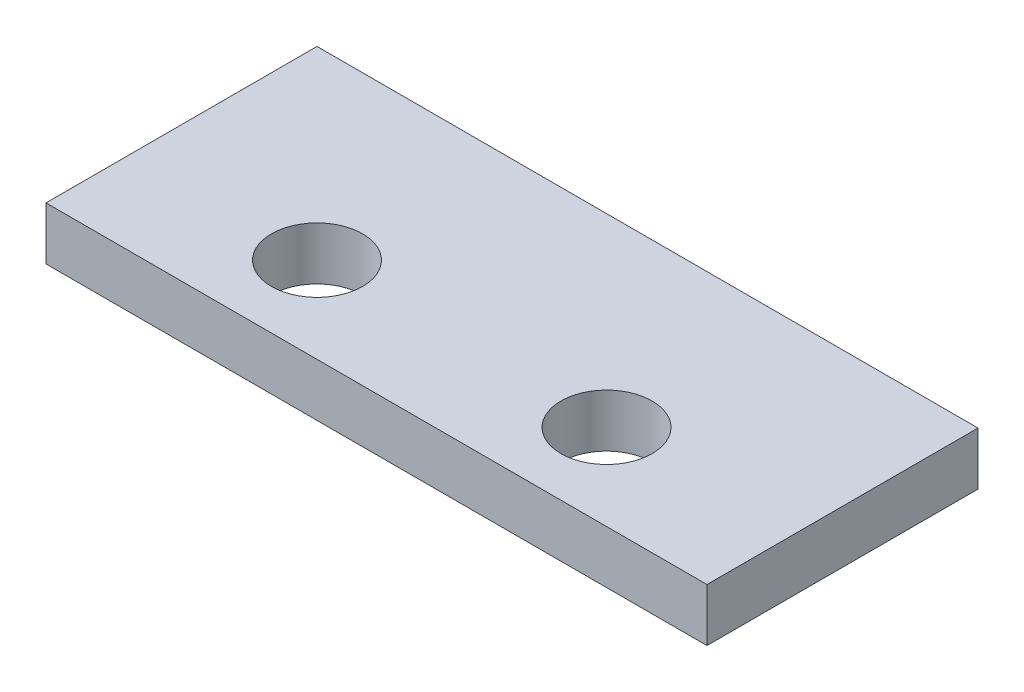
ISO-10303-21;
HEADER;
FILE_DESCRIPTION(('STEP AP214'),'2;1');
FILE_NAME('part.step','',(''),(''),'','','');
FILE_SCHEMA(('AUTOMOTIVE_DESIGN { 1 0 10303 214 1 1 1 1 }'));
ENDSEC;
DATA;
#1=APPLICATION_CONTEXT('core data for automotive mechanical design processes');
#2=APPLICATION_PROTOCOL_DEFINITION('international standard','automotive_design',2000,#1);
#3=PRODUCT_CONTEXT('',#1,'mechanical');
#4=PRODUCT('Part','Part','',(#3));
#5=PRODUCT_RELATED_PRODUCT_CATEGORY('part','',(#4));
#6=PRODUCT_DEFINITION_FORMATION('','',#4);
#7=PRODUCT_DEFINITION_CONTEXT('part definition',#1,'design');
#8=PRODUCT_DEFINITION('design','',#6,#7);
#9=PRODUCT_DEFINITION_SHAPE('','',#8);
#10=(LENGTH_UNIT() NAMED_UNIT(*) SI_UNIT(.MILLI.,.METRE.));
#11=(NAMED_UNIT(*) PLANE_ANGLE_UNIT() SI_UNIT($,.RADIAN.));
#12=(NAMED_UNIT(*) SI_UNIT($,.STERADIAN.) SOLID_ANGLE_UNIT());
#13=UNCERTAINTY_MEASURE_WITH_UNIT(LENGTH_MEASURE(1.E-05),#10,'distance_accuracy_value','');
#14=(GEOMETRIC_REPRESENTATION_CONTEXT(3) GLOBAL_UNCERTAINTY_ASSIGNED_CONTEXT((#13)) GLOBAL_UNIT_ASSIGNED_CONTEXT((#10,
#11,#12)) REPRESENTATION_CONTEXT('',''));
#15=CARTESIAN_POINT('',(0.,0.,0.));
#16=DIRECTION('',(0.,0.,1.));
#17=DIRECTION('',(1.,0.,0.));
#18=AXIS2_PLACEMENT_3D('',#15,#16,#17);
#19=CARTESIAN_POINT('',(0.,2.032,0.));
#20=DIRECTION('',(0.,1.,0.));
#21=DIRECTION('',(0.,0.,1.));
#22=AXIS2_PLACEMENT_3D('',#19,#20,#21);
#23=PLANE('',#22);
#24=CARTESIAN_POINT('',(-4.53841322314049,2.032,4.58302066115703));
#25=DIRECTION('',(0.,1.,0.));
#26=DIRECTION('',(0.,0.,1.));
#27=AXIS2_PLACEMENT_3D('',#24,#25,#26);
#28=CIRCLE('',#27,1.7526);
#29=CARTESIAN_POINT('',(-4.53841322314049,2.032,6.33562066115703));
#30=VERTEX_POINT('',#29);
#31=EDGE_CURVE('E104',#30,#30,#28,.T.);
#32=ORIENTED_EDGE('',*,*,#31,.F.);
#33=EDGE_LOOP('',(#32));
#34=FACE_BOUND('',#33,.T.);
#35=DIRECTION('',(0.,0.,1.));
#36=VECTOR('',#35,1.);
#37=CARTESIAN_POINT('',(-11.6504132231405,2.032,-2.52897933884297));
#38=LINE('',#37,#36);
#39=CARTESIAN_POINT('',(-11.6504132231405,2.032,-2.52897933884297));
#40=VERTEX_POINT('',#39);
#41=CARTESIAN_POINT('',(-11.6504132231405,2.032,7.88502066115703));
#42=VERTEX_POINT('',#41);
#43=EDGE_CURVE('E89',#40,#42,#38,.T.);
#44=ORIENTED_EDGE('',*,*,#43,.T.);
#45=DIRECTION('',(1.,0.,0.));
#46=VECTOR('',#45,1.);
#47=CARTESIAN_POINT('',(-11.6504132231405,2.032,7.88502066115703));
#48=LINE('',#47,#46);
#49=CARTESIAN_POINT('',(13.7495867768595,2.032,7.88502066115703));
#50=VERTEX_POINT('',#49);
#51=EDGE_CURVE('E84',#42,#50,#48,.T.);
#52=ORIENTED_EDGE('',*,*,#51,.T.);
#53=DIRECTION('',(0.,0.,-1.));
#54=VECTOR('',#53,1.);
#55=CARTESIAN_POINT('',(13.7495867768595,2.032,-2.52897933884297));
#56=LINE('',#55,#54);
#57=CARTESIAN_POINT('',(13.7495867768595,2.032,-2.52897933884297));
#58=VERTEX_POINT('',#57);
#59=EDGE_CURVE('E87',#50,#58,#56,.T.);
#60=ORIENTED_EDGE('',*,*,#59,.T.);
#61=DIRECTION('',(-1.,0.,0.));
#62=VECTOR('',#61,1.);
#63=CARTESIAN_POINT('',(-11.6504132231405,2.032,-2.52897933884297));
#64=LINE('',#63,#62);
#65=EDGE_CURVE('E54',#58,#40,#64,.T.);
#66=ORIENTED_EDGE('',*,*,#65,.T.);
#67=EDGE_LOOP('',(#44,#52,#60,#66));
#68=FACE_BOUND('',#67,.T.);
#69=CARTESIAN_POINT('',(6.58678677685951,2.032,4.58302066115703));
#70=DIRECTION('',(0.,1.,0.));
#71=DIRECTION('',(0.,0.,1.));
#72=AXIS2_PLACEMENT_3D('',#69,#70,#71);
#73=CIRCLE('',#72,1.7526);
#74=CARTESIAN_POINT('',(6.58678677685951,2.032,6.33562066115703));
#75=VERTEX_POINT('',#74);
#76=EDGE_CURVE('E119',#75,#75,#73,.T.);
#77=ORIENTED_EDGE('',*,*,#76,.F.);
#78=EDGE_LOOP('',(#77));
#79=FACE_BOUND('',#78,.T.);
#80=ADVANCED_FACE('F37',(#34,#68,#79),#23,.T.);
#81=CARTESIAN_POINT('',(0.,0.,0.));
#82=DIRECTION('',(0.,1.,0.));
#83=DIRECTION('',(0.,0.,1.));
#84=AXIS2_PLACEMENT_3D('',#81,#82,#83);
#85=PLANE('',#84);
#86=DIRECTION('',(0.,0.,1.));
#87=VECTOR('',#86,1.);
#88=CARTESIAN_POINT('',(-11.6504132231405,0.,-2.52897933884297));
#89=LINE('',#88,#87);
#90=CARTESIAN_POINT('',(-11.6504132231405,0.,-2.52897933884297));
#91=VERTEX_POINT('',#90);
#92=CARTESIAN_POINT('',(-11.6504132231405,0.,7.88502066115703));
#93=VERTEX_POINT('',#92);
#94=EDGE_CURVE('E101',#91,#93,#89,.T.);
#95=ORIENTED_EDGE('',*,*,#94,.F.);
#96=DIRECTION('',(-1.,0.,0.));
#97=VECTOR('',#96,1.);
#98=CARTESIAN_POINT('',(-11.6504132231405,0.,-2.52897933884297));
#99=LINE('',#98,#97);
#100=CARTESIAN_POINT('',(13.7495867768595,0.,-2.52897933884297));
#101=VERTEX_POINT('',#100);
#102=EDGE_CURVE('E77',#101,#91,#99,.T.);
#103=ORIENTED_EDGE('',*,*,#102,.F.);
#104=DIRECTION('',(0.,0.,-1.));
#105=VECTOR('',#104,1.);
#106=CARTESIAN_POINT('',(13.7495867768595,0.,-2.52897933884297));
#107=LINE('',#106,#105);
#108=CARTESIAN_POINT('',(13.7495867768595,0.,7.88502066115703));
#109=VERTEX_POINT('',#108);
#110=EDGE_CURVE('E71',#109,#101,#107,.T.);
#111=ORIENTED_EDGE('',*,*,#110,.F.);
#112=DIRECTION('',(1.,0.,0.));
#113=VECTOR('',#112,1.);
#114=CARTESIAN_POINT('',(-11.6504132231405,0.,7.88502066115703));
#115=LINE('',#114,#113);
#116=EDGE_CURVE('E93',#93,#109,#115,.T.);
#117=ORIENTED_EDGE('',*,*,#116,.F.);
#118=EDGE_LOOP('',(#95,#103,#111,#117));
#119=FACE_BOUND('',#118,.T.);
#120=CARTESIAN_POINT('',(-4.53841322314049,0.,4.58302066115703));
#121=DIRECTION('',(0.,1.,0.));
#122=DIRECTION('',(0.,0.,1.));
#123=AXIS2_PLACEMENT_3D('',#120,#121,#122);
#124=CIRCLE('',#123,1.7526);
#125=CARTESIAN_POINT('',(-4.53841322314049,0.,6.33562066115703));
#126=VERTEX_POINT('',#125);
#127=EDGE_CURVE('E116',#126,#126,#124,.T.);
#128=ORIENTED_EDGE('',*,*,#127,.T.);
#129=EDGE_LOOP('',(#128));
#130=FACE_BOUND('',#129,.T.);
#131=CARTESIAN_POINT('',(6.58678677685951,0.,4.58302066115703));
#132=DIRECTION('',(0.,1.,0.));
#133=DIRECTION('',(0.,0.,1.));
#134=AXIS2_PLACEMENT_3D('',#131,#132,#133);
#135=CIRCLE('',#134,1.7526);
#136=CARTESIAN_POINT('',(6.58678677685951,0.,6.33562066115703));
#137=VERTEX_POINT('',#136);
#138=EDGE_CURVE('E122',#137,#137,#135,.T.);
#139=ORIENTED_EDGE('',*,*,#138,.T.);
#140=EDGE_LOOP('',(#139));
#141=FACE_BOUND('',#140,.T.);
#142=ADVANCED_FACE('F112',(#119,#130,#141),#85,.F.);
#143=CARTESIAN_POINT('',(-11.6504132231405,2.032,-2.52897933884297));
#144=DIRECTION('',(1.,0.,0.));
#145=DIRECTION('',(0.,0.,-1.));
#146=AXIS2_PLACEMENT_3D('',#143,#144,#145);
#147=PLANE('',#146);
#148=ORIENTED_EDGE('',*,*,#94,.T.);
#149=DIRECTION('',(0.,-1.,0.));
#150=VECTOR('',#149,1.);
#151=CARTESIAN_POINT('',(-11.6504132231405,2.032,7.88502066115703));
#152=LINE('',#151,#150);
#153=EDGE_CURVE('E11',#42,#93,#152,.T.);
#154=ORIENTED_EDGE('',*,*,#153,.F.);
#155=ORIENTED_EDGE('',*,*,#43,.F.);
#156=DIRECTION('',(0.,-1.,0.));
#157=VECTOR('',#156,1.);
#158=CARTESIAN_POINT('',(-11.6504132231405,2.032,-2.52897933884297));
#159=LINE('',#158,#157);
#160=EDGE_CURVE('E97',#40,#91,#159,.T.);
#161=ORIENTED_EDGE('',*,*,#160,.T.);
#162=EDGE_LOOP('',(#148,#154,#155,#161));
#163=FACE_BOUND('',#162,.T.);
#164=ADVANCED_FACE('F39',(#163),#147,.F.);
#165=CARTESIAN_POINT('',(-11.6504132231405,2.032,7.88502066115703));
#166=DIRECTION('',(0.,0.,-1.));
#167=DIRECTION('',(-1.,0.,0.));
#168=AXIS2_PLACEMENT_3D('',#165,#166,#167);
#169=PLANE('',#168);
#170=ORIENTED_EDGE('',*,*,#116,.T.);
#171=DIRECTION('',(0.,-1.,0.));
#172=VECTOR('',#171,1.);
#173=CARTESIAN_POINT('',(13.7495867768595,2.032,7.88502066115703));
#174=LINE('',#173,#172);
#175=EDGE_CURVE('E46',#50,#109,#174,.T.);
#176=ORIENTED_EDGE('',*,*,#175,.F.);
#177=ORIENTED_EDGE('',*,*,#51,.F.);
#178=ORIENTED_EDGE('',*,*,#153,.T.);
#179=EDGE_LOOP('',(#170,#176,#177,#178));
#180=FACE_BOUND('',#179,.T.);
#181=ADVANCED_FACE('F92',(#180),#169,.F.);
#182=CARTESIAN_POINT('',(13.7495867768595,2.032,-2.52897933884297));
#183=DIRECTION('',(-1.,0.,0.));
#184=DIRECTION('',(0.,0.,1.));
#185=AXIS2_PLACEMENT_3D('',#182,#183,#184);
#186=PLANE('',#185);
#187=ORIENTED_EDGE('',*,*,#110,.T.);
#188=DIRECTION('',(0.,-1.,0.));
#189=VECTOR('',#188,1.);
#190=CARTESIAN_POINT('',(13.7495867768595,2.032,-2.52897933884297));
#191=LINE('',#190,#189);
#192=EDGE_CURVE('E94',#58,#101,#191,.T.);
#193=ORIENTED_EDGE('',*,*,#192,.F.);
#194=ORIENTED_EDGE('',*,*,#59,.F.);
#195=ORIENTED_EDGE('',*,*,#175,.T.);
#196=EDGE_LOOP('',(#187,#193,#194,#195));
#197=FACE_BOUND('',#196,.T.);
#198=ADVANCED_FACE('F95',(#197),#186,.F.);
#199=CARTESIAN_POINT('',(-11.6504132231405,2.032,-2.52897933884297));
#200=DIRECTION('',(0.,0.,1.));
#201=DIRECTION('',(1.,0.,0.));
#202=AXIS2_PLACEMENT_3D('',#199,#200,#201);
#203=PLANE('',#202);
#204=ORIENTED_EDGE('',*,*,#102,.T.);
#205=ORIENTED_EDGE('',*,*,#160,.F.);
#206=ORIENTED_EDGE('',*,*,#65,.F.);
#207=ORIENTED_EDGE('',*,*,#192,.T.);
#208=EDGE_LOOP('',(#204,#205,#206,#207));
#209=FACE_BOUND('',#208,.T.);
#210=ADVANCED_FACE('F109',(#209),#203,.F.);
#211=CARTESIAN_POINT('',(-4.53841322314049,2.032,4.58302066115703));
#212=DIRECTION('',(0.,-1.,0.));
#213=DIRECTION('',(0.,0.,-1.));
#214=AXIS2_PLACEMENT_3D('',#211,#212,#213);
#215=CYLINDRICAL_SURFACE('',#214,1.7526);
#216=ORIENTED_EDGE('',*,*,#31,.T.);
#217=EDGE_LOOP('',(#216));
#218=FACE_BOUND('',#217,.T.);
#219=ORIENTED_EDGE('',*,*,#127,.F.);
#220=EDGE_LOOP('',(#219));
#221=FACE_BOUND('',#220,.T.);
#222=ADVANCED_FACE('F139',(#218,#221),#215,.F.);
#223=CARTESIAN_POINT('',(6.58678677685951,2.032,4.58302066115703));
#224=DIRECTION('',(0.,-1.,0.));
#225=DIRECTION('',(0.,0.,-1.));
#226=AXIS2_PLACEMENT_3D('',#223,#224,#225);
#227=CYLINDRICAL_SURFACE('',#226,1.7526);
#228=ORIENTED_EDGE('',*,*,#76,.T.);
#229=EDGE_LOOP('',(#228));
#230=FACE_BOUND('',#229,.T.);
#231=ORIENTED_EDGE('',*,*,#138,.F.);
#232=EDGE_LOOP('',(#231));
#233=FACE_BOUND('',#232,.T.);
#234=ADVANCED_FACE('F128',(#230,#233),#227,.F.);
#235=CLOSED_SHELL('',(#80,#142,#164,#181,#198,#210,#222,#234));
#236=MANIFOLD_SOLID_BREP('B2',#235);
#237=ADVANCED_BREP_SHAPE_REPRESENTATION('',(#18,#236),#14);
#238=SHAPE_DEFINITION_REPRESENTATION(#9,#237);
ENDSEC;
END-ISO-10303-21;
